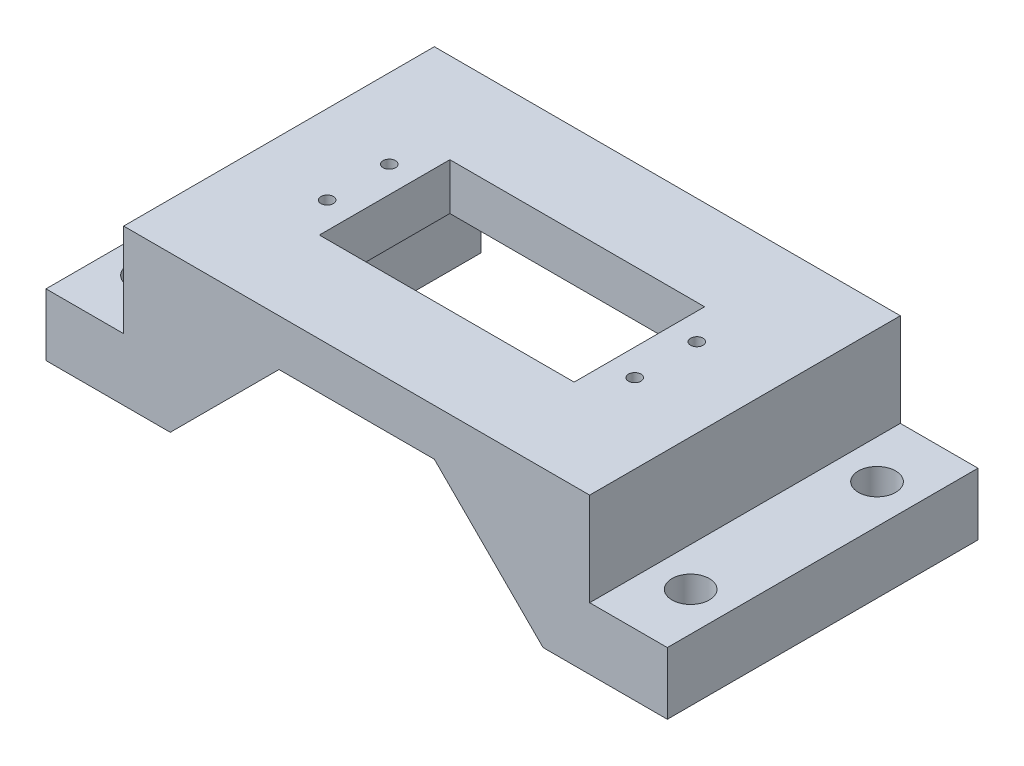
ISO-10303-21;
HEADER;
FILE_DESCRIPTION(('STEP AP214'),'2;1');
FILE_NAME('part.step','',(''),(''),'','','');
FILE_SCHEMA(('AUTOMOTIVE_DESIGN { 1 0 10303 214 1 1 1 1 }'));
ENDSEC;
DATA;
#1=APPLICATION_CONTEXT('core data for automotive mechanical design processes');
#2=APPLICATION_PROTOCOL_DEFINITION('international standard','automotive_design',2000,#1);
#3=PRODUCT_CONTEXT('',#1,'mechanical');
#4=PRODUCT('Part','Part','',(#3));
#5=PRODUCT_RELATED_PRODUCT_CATEGORY('part','',(#4));
#6=PRODUCT_DEFINITION_FORMATION('','',#4);
#7=PRODUCT_DEFINITION_CONTEXT('part definition',#1,'design');
#8=PRODUCT_DEFINITION('design','',#6,#7);
#9=PRODUCT_DEFINITION_SHAPE('','',#8);
#10=(LENGTH_UNIT() NAMED_UNIT(*) SI_UNIT(.MILLI.,.METRE.));
#11=(NAMED_UNIT(*) PLANE_ANGLE_UNIT() SI_UNIT($,.RADIAN.));
#12=(NAMED_UNIT(*) SI_UNIT($,.STERADIAN.) SOLID_ANGLE_UNIT());
#13=UNCERTAINTY_MEASURE_WITH_UNIT(LENGTH_MEASURE(1.E-05),#10,'distance_accuracy_value','');
#14=(GEOMETRIC_REPRESENTATION_CONTEXT(3) GLOBAL_UNCERTAINTY_ASSIGNED_CONTEXT((#13)) GLOBAL_UNIT_ASSIGNED_CONTEXT((#10,
#11,#12)) REPRESENTATION_CONTEXT('',''));
#15=CARTESIAN_POINT('',(0.,0.,0.));
#16=DIRECTION('',(0.,0.,1.));
#17=DIRECTION('',(1.,0.,0.));
#18=AXIS2_PLACEMENT_3D('',#15,#16,#17);
#19=CARTESIAN_POINT('',(-50.002,17.5,-25.));
#20=DIRECTION('',(0.,1.,0.));
#21=DIRECTION('',(0.,0.,1.));
#22=AXIS2_PLACEMENT_3D('',#19,#20,#21);
#23=PLANE('',#22);
#24=CARTESIAN_POINT('',(-24.75,17.5,-4.99999999999999));
#25=DIRECTION('',(0.,1.,0.));
#26=DIRECTION('',(0.,0.,1.));
#27=AXIS2_PLACEMENT_3D('',#24,#25,#26);
#28=CIRCLE('',#27,1.);
#29=CARTESIAN_POINT('',(-24.75,17.5,-3.99999999999999));
#30=VERTEX_POINT('',#29);
#31=EDGE_CURVE('E269',#30,#30,#28,.T.);
#32=ORIENTED_EDGE('',*,*,#31,.T.);
#33=EDGE_LOOP('',(#32));
#34=FACE_BOUND('',#33,.T.);
#35=CARTESIAN_POINT('',(24.75,17.5,-5.));
#36=DIRECTION('',(0.,1.,0.));
#37=DIRECTION('',(0.,0.,1.));
#38=AXIS2_PLACEMENT_3D('',#35,#36,#37);
#39=CIRCLE('',#38,1.);
#40=CARTESIAN_POINT('',(24.75,17.5,-4.));
#41=VERTEX_POINT('',#40);
#42=EDGE_CURVE('E265',#41,#41,#39,.T.);
#43=ORIENTED_EDGE('',*,*,#42,.T.);
#44=EDGE_LOOP('',(#43));
#45=FACE_BOUND('',#44,.T.);
#46=CARTESIAN_POINT('',(-24.75,17.5,5.00000000000001));
#47=DIRECTION('',(0.,1.,0.));
#48=DIRECTION('',(0.,0.,1.));
#49=AXIS2_PLACEMENT_3D('',#46,#47,#48);
#50=CIRCLE('',#49,1.);
#51=CARTESIAN_POINT('',(-24.75,17.5,6.00000000000001));
#52=VERTEX_POINT('',#51);
#53=EDGE_CURVE('E260',#52,#52,#50,.T.);
#54=ORIENTED_EDGE('',*,*,#53,.T.);
#55=EDGE_LOOP('',(#54));
#56=FACE_BOUND('',#55,.T.);
#57=DIRECTION('',(0.,0.,-1.));
#58=VECTOR('',#57,1.);
#59=CARTESIAN_POINT('',(20.5,17.5,-25.));
#60=LINE('',#59,#58);
#61=CARTESIAN_POINT('',(20.5,17.5,10.5));
#62=VERTEX_POINT('',#61);
#63=CARTESIAN_POINT('',(20.5,17.5,-10.5));
#64=VERTEX_POINT('',#63);
#65=EDGE_CURVE('E253',#62,#64,#60,.T.);
#66=ORIENTED_EDGE('',*,*,#65,.T.);
#67=DIRECTION('',(-1.,0.,0.));
#68=VECTOR('',#67,1.);
#69=CARTESIAN_POINT('',(-50.002,17.5,-10.5));
#70=LINE('',#69,#68);
#71=CARTESIAN_POINT('',(-20.5,17.5,-10.5));
#72=VERTEX_POINT('',#71);
#73=EDGE_CURVE('E256',#64,#72,#70,.T.);
#74=ORIENTED_EDGE('',*,*,#73,.T.);
#75=DIRECTION('',(0.,0.,1.));
#76=VECTOR('',#75,1.);
#77=CARTESIAN_POINT('',(-20.5,17.5,-25.));
#78=LINE('',#77,#76);
#79=CARTESIAN_POINT('',(-20.5,17.5,10.5));
#80=VERTEX_POINT('',#79);
#81=EDGE_CURVE('E242',#72,#80,#78,.T.);
#82=ORIENTED_EDGE('',*,*,#81,.T.);
#83=DIRECTION('',(1.,0.,0.));
#84=VECTOR('',#83,1.);
#85=CARTESIAN_POINT('',(-50.002,17.5,10.5));
#86=LINE('',#85,#84);
#87=EDGE_CURVE('E250',#80,#62,#86,.T.);
#88=ORIENTED_EDGE('',*,*,#87,.T.);
#89=EDGE_LOOP('',(#66,#74,#82,#88));
#90=FACE_BOUND('',#89,.T.);
#91=CARTESIAN_POINT('',(24.75,17.5,5.));
#92=DIRECTION('',(0.,1.,0.));
#93=DIRECTION('',(0.,0.,1.));
#94=AXIS2_PLACEMENT_3D('',#91,#92,#93);
#95=CIRCLE('',#94,1.);
#96=CARTESIAN_POINT('',(24.75,17.5,6.));
#97=VERTEX_POINT('',#96);
#98=EDGE_CURVE('E243',#97,#97,#95,.T.);
#99=ORIENTED_EDGE('',*,*,#98,.T.);
#100=EDGE_LOOP('',(#99));
#101=FACE_BOUND('',#100,.T.);
#102=DIRECTION('',(1.,0.,0.));
#103=VECTOR('',#102,1.);
#104=CARTESIAN_POINT('',(30.,17.5,15.));
#105=LINE('',#104,#103);
#106=CARTESIAN_POINT('',(12.5000000000001,17.5,15.));
#107=VERTEX_POINT('',#106);
#108=CARTESIAN_POINT('',(30.,17.5,15.));
#109=VERTEX_POINT('',#108);
#110=EDGE_CURVE('E167',#107,#109,#105,.T.);
#111=ORIENTED_EDGE('',*,*,#110,.F.);
#112=DIRECTION('',(0.,0.,-1.));
#113=VECTOR('',#112,1.);
#114=CARTESIAN_POINT('',(12.5000000000002,17.5,-25.));
#115=LINE('',#114,#113);
#116=CARTESIAN_POINT('',(12.5000000000001,17.5,25.));
#117=VERTEX_POINT('',#116);
#118=EDGE_CURVE('E51',#107,#117,#115,.F.);
#119=ORIENTED_EDGE('',*,*,#118,.T.);
#120=DIRECTION('',(1.,0.,0.));
#121=VECTOR('',#120,1.);
#122=CARTESIAN_POINT('',(-50.002,17.5,25.));
#123=LINE('',#122,#121);
#124=CARTESIAN_POINT('',(-12.5000000000002,17.5,25.));
#125=VERTEX_POINT('',#124);
#126=EDGE_CURVE('E188',#125,#117,#123,.T.);
#127=ORIENTED_EDGE('',*,*,#126,.F.);
#128=DIRECTION('',(0.,0.,1.));
#129=VECTOR('',#128,1.);
#130=CARTESIAN_POINT('',(-12.5000000000002,17.5,-25.));
#131=LINE('',#130,#129);
#132=CARTESIAN_POINT('',(-12.5000000000002,17.5,15.));
#133=VERTEX_POINT('',#132);
#134=EDGE_CURVE('E11',#125,#133,#131,.F.);
#135=ORIENTED_EDGE('',*,*,#134,.T.);
#136=DIRECTION('',(1.,0.,0.));
#137=VECTOR('',#136,1.);
#138=CARTESIAN_POINT('',(-30.,17.5,15.));
#139=LINE('',#138,#137);
#140=CARTESIAN_POINT('',(-30.,17.5,15.));
#141=VERTEX_POINT('',#140);
#142=EDGE_CURVE('E183',#141,#133,#139,.T.);
#143=ORIENTED_EDGE('',*,*,#142,.F.);
#144=DIRECTION('',(0.,0.,1.));
#145=VECTOR('',#144,1.);
#146=CARTESIAN_POINT('',(-30.,17.5,-25.));
#147=LINE('',#146,#145);
#148=CARTESIAN_POINT('',(-30.,17.5,-25.));
#149=VERTEX_POINT('',#148);
#150=EDGE_CURVE('E197',#149,#141,#147,.T.);
#151=ORIENTED_EDGE('',*,*,#150,.F.);
#152=DIRECTION('',(1.,0.,0.));
#153=VECTOR('',#152,1.);
#154=CARTESIAN_POINT('',(-50.002,17.5,-25.));
#155=LINE('',#154,#153);
#156=CARTESIAN_POINT('',(30.,17.5,-25.));
#157=VERTEX_POINT('',#156);
#158=EDGE_CURVE('E187',#149,#157,#155,.T.);
#159=ORIENTED_EDGE('',*,*,#158,.T.);
#160=DIRECTION('',(0.,0.,1.));
#161=VECTOR('',#160,1.);
#162=CARTESIAN_POINT('',(30.,17.5,-25.));
#163=LINE('',#162,#161);
#164=EDGE_CURVE('E180',#157,#109,#163,.T.);
#165=ORIENTED_EDGE('',*,*,#164,.T.);
#166=EDGE_LOOP('',(#111,#119,#127,#135,#143,#151,#159,#165));
#167=FACE_BOUND('',#166,.T.);
#168=ADVANCED_FACE('F41',(#34,#45,#56,#90,#101,#167),#23,.F.);
#169=CARTESIAN_POINT('',(30.,10.,0.));
#170=DIRECTION('',(-1.,0.,0.));
#171=DIRECTION('',(0.,0.,1.));
#172=AXIS2_PLACEMENT_3D('',#169,#170,#171);
#173=PLANE('',#172);
#174=DIRECTION('',(0.,0.,-1.));
#175=VECTOR('',#174,1.);
#176=CARTESIAN_POINT('',(30.,0.,0.));
#177=LINE('',#176,#175);
#178=CARTESIAN_POINT('',(30.,0.,15.));
#179=VERTEX_POINT('',#178);
#180=CARTESIAN_POINT('',(30.,0.,-25.));
#181=VERTEX_POINT('',#180);
#182=EDGE_CURVE('E182',#179,#181,#177,.T.);
#183=ORIENTED_EDGE('',*,*,#182,.F.);
#184=DIRECTION('',(0.,1.,0.));
#185=VECTOR('',#184,1.);
#186=CARTESIAN_POINT('',(30.,-22.3606797749979,15.));
#187=LINE('',#186,#185);
#188=EDGE_CURVE('E170',#179,#109,#187,.T.);
#189=ORIENTED_EDGE('',*,*,#188,.T.);
#190=ORIENTED_EDGE('',*,*,#164,.F.);
#191=DIRECTION('',(0.,-1.,0.));
#192=VECTOR('',#191,1.);
#193=CARTESIAN_POINT('',(30.,10.,-25.));
#194=LINE('',#193,#192);
#195=EDGE_CURVE('E309',#157,#181,#194,.T.);
#196=ORIENTED_EDGE('',*,*,#195,.T.);
#197=EDGE_LOOP('',(#183,#189,#190,#196));
#198=FACE_BOUND('',#197,.T.);
#199=ADVANCED_FACE('F178',(#198),#173,.T.);
#200=CARTESIAN_POINT('',(-30.,10.,0.));
#201=DIRECTION('',(-1.,0.,0.));
#202=DIRECTION('',(0.,0.,1.));
#203=AXIS2_PLACEMENT_3D('',#200,#201,#202);
#204=PLANE('',#203);
#205=DIRECTION('',(0.,1.,0.));
#206=VECTOR('',#205,1.);
#207=CARTESIAN_POINT('',(-30.,-22.3606797749979,15.));
#208=LINE('',#207,#206);
#209=CARTESIAN_POINT('',(-30.,0.,15.));
#210=VERTEX_POINT('',#209);
#211=EDGE_CURVE('E327',#210,#141,#208,.T.);
#212=ORIENTED_EDGE('',*,*,#211,.F.);
#213=DIRECTION('',(0.,0.,-1.));
#214=VECTOR('',#213,1.);
#215=CARTESIAN_POINT('',(-30.,0.,0.));
#216=LINE('',#215,#214);
#217=CARTESIAN_POINT('',(-30.,0.,-25.));
#218=VERTEX_POINT('',#217);
#219=EDGE_CURVE('E229',#210,#218,#216,.T.);
#220=ORIENTED_EDGE('',*,*,#219,.T.);
#221=DIRECTION('',(0.,-1.,0.));
#222=VECTOR('',#221,1.);
#223=CARTESIAN_POINT('',(-30.,10.,-25.));
#224=LINE('',#223,#222);
#225=EDGE_CURVE('E239',#149,#218,#224,.T.);
#226=ORIENTED_EDGE('',*,*,#225,.F.);
#227=ORIENTED_EDGE('',*,*,#150,.T.);
#228=EDGE_LOOP('',(#212,#220,#226,#227));
#229=FACE_BOUND('',#228,.T.);
#230=ADVANCED_FACE('F324',(#229),#204,.F.);
#231=CARTESIAN_POINT('',(0.,10.,25.));
#232=DIRECTION('',(0.,0.,-1.));
#233=DIRECTION('',(-1.,0.,0.));
#234=AXIS2_PLACEMENT_3D('',#231,#232,#233);
#235=PLANE('',#234);
#236=ORIENTED_EDGE('',*,*,#126,.T.);
#237=DIRECTION('',(-0.707106781186551,0.707106781186544,0.));
#238=VECTOR('',#237,1.);
#239=CARTESIAN_POINT('',(9.99999999999997,20.0000000000001,25.));
#240=LINE('',#239,#238);
#241=CARTESIAN_POINT('',(30.0000000000003,0.,25.));
#242=VERTEX_POINT('',#241);
#243=EDGE_CURVE('E275',#117,#242,#240,.F.);
#244=ORIENTED_EDGE('',*,*,#243,.T.);
#245=DIRECTION('',(1.,0.,0.));
#246=VECTOR('',#245,1.);
#247=CARTESIAN_POINT('',(0.,0.,25.));
#248=LINE('',#247,#246);
#249=CARTESIAN_POINT('',(50.,0.,25.));
#250=VERTEX_POINT('',#249);
#251=EDGE_CURVE('E293',#242,#250,#248,.T.);
#252=ORIENTED_EDGE('',*,*,#251,.T.);
#253=DIRECTION('',(0.,-1.,0.));
#254=VECTOR('',#253,1.);
#255=CARTESIAN_POINT('',(50.,10.,25.));
#256=LINE('',#255,#254);
#257=CARTESIAN_POINT('',(50.,10.,25.));
#258=VERTEX_POINT('',#257);
#259=EDGE_CURVE('E189',#258,#250,#256,.T.);
#260=ORIENTED_EDGE('',*,*,#259,.F.);
#261=DIRECTION('',(1.,0.,0.));
#262=VECTOR('',#261,1.);
#263=CARTESIAN_POINT('',(0.,10.,25.));
#264=LINE('',#263,#262);
#265=CARTESIAN_POINT('',(37.5,10.,25.));
#266=VERTEX_POINT('',#265);
#267=EDGE_CURVE('E308',#266,#258,#264,.T.);
#268=ORIENTED_EDGE('',*,*,#267,.F.);
#269=DIRECTION('',(0.,-1.,0.));
#270=VECTOR('',#269,1.);
#271=CARTESIAN_POINT('',(37.5,25.,25.));
#272=LINE('',#271,#270);
#273=CARTESIAN_POINT('',(37.5,25.,25.));
#274=VERTEX_POINT('',#273);
#275=EDGE_CURVE('E303',#274,#266,#272,.T.);
#276=ORIENTED_EDGE('',*,*,#275,.F.);
#277=DIRECTION('',(1.,0.,0.));
#278=VECTOR('',#277,1.);
#279=CARTESIAN_POINT('',(-30.,25.,25.));
#280=LINE('',#279,#278);
#281=CARTESIAN_POINT('',(-37.5,25.,25.));
#282=VERTEX_POINT('',#281);
#283=EDGE_CURVE('E206',#282,#274,#280,.T.);
#284=ORIENTED_EDGE('',*,*,#283,.F.);
#285=DIRECTION('',(0.,-1.,0.));
#286=VECTOR('',#285,1.);
#287=CARTESIAN_POINT('',(-37.5,25.,25.));
#288=LINE('',#287,#286);
#289=CARTESIAN_POINT('',(-37.5,10.,25.));
#290=VERTEX_POINT('',#289);
#291=EDGE_CURVE('E208',#282,#290,#288,.T.);
#292=ORIENTED_EDGE('',*,*,#291,.T.);
#293=DIRECTION('',(1.,0.,0.));
#294=VECTOR('',#293,1.);
#295=CARTESIAN_POINT('',(0.,10.,25.));
#296=LINE('',#295,#294);
#297=CARTESIAN_POINT('',(-50.,10.,25.));
#298=VERTEX_POINT('',#297);
#299=EDGE_CURVE('E217',#298,#290,#296,.T.);
#300=ORIENTED_EDGE('',*,*,#299,.F.);
#301=DIRECTION('',(0.,-1.,0.));
#302=VECTOR('',#301,1.);
#303=CARTESIAN_POINT('',(-50.,10.,25.));
#304=LINE('',#303,#302);
#305=CARTESIAN_POINT('',(-50.,0.,25.));
#306=VERTEX_POINT('',#305);
#307=EDGE_CURVE('E226',#298,#306,#304,.T.);
#308=ORIENTED_EDGE('',*,*,#307,.T.);
#309=DIRECTION('',(1.,0.,0.));
#310=VECTOR('',#309,1.);
#311=CARTESIAN_POINT('',(0.,0.,25.));
#312=LINE('',#311,#310);
#313=CARTESIAN_POINT('',(-30.0000000000004,0.,25.));
#314=VERTEX_POINT('',#313);
#315=EDGE_CURVE('E216',#306,#314,#312,.T.);
#316=ORIENTED_EDGE('',*,*,#315,.T.);
#317=DIRECTION('',(-0.707106781186551,-0.707106781186544,0.));
#318=VECTOR('',#317,1.);
#319=CARTESIAN_POINT('',(-10.,20.0000000000001,25.));
#320=LINE('',#319,#318);
#321=EDGE_CURVE('E259',#314,#125,#320,.F.);
#322=ORIENTED_EDGE('',*,*,#321,.T.);
#323=EDGE_LOOP('',(#236,#244,#252,#260,#268,#276,#284,#292,#300,#308,#316,#322));
#324=FACE_BOUND('',#323,.T.);
#325=ADVANCED_FACE('F291',(#324),#235,.F.);
#326=CARTESIAN_POINT('',(0.,10.,-25.));
#327=DIRECTION('',(0.,0.,-1.));
#328=DIRECTION('',(-1.,0.,0.));
#329=AXIS2_PLACEMENT_3D('',#326,#327,#328);
#330=PLANE('',#329);
#331=DIRECTION('',(1.,0.,0.));
#332=VECTOR('',#331,1.);
#333=CARTESIAN_POINT('',(0.,0.,-25.));
#334=LINE('',#333,#332);
#335=CARTESIAN_POINT('',(-50.,0.,-25.));
#336=VERTEX_POINT('',#335);
#337=EDGE_CURVE('E231',#336,#218,#334,.T.);
#338=ORIENTED_EDGE('',*,*,#337,.F.);
#339=DIRECTION('',(0.,-1.,0.));
#340=VECTOR('',#339,1.);
#341=CARTESIAN_POINT('',(-50.,10.,-25.));
#342=LINE('',#341,#340);
#343=CARTESIAN_POINT('',(-50.,10.,-25.));
#344=VERTEX_POINT('',#343);
#345=EDGE_CURVE('E237',#344,#336,#342,.T.);
#346=ORIENTED_EDGE('',*,*,#345,.F.);
#347=DIRECTION('',(1.,0.,0.));
#348=VECTOR('',#347,1.);
#349=CARTESIAN_POINT('',(0.,10.,-25.));
#350=LINE('',#349,#348);
#351=CARTESIAN_POINT('',(-37.5,10.,-25.));
#352=VERTEX_POINT('',#351);
#353=EDGE_CURVE('E219',#344,#352,#350,.T.);
#354=ORIENTED_EDGE('',*,*,#353,.T.);
#355=DIRECTION('',(0.,-1.,0.));
#356=VECTOR('',#355,1.);
#357=CARTESIAN_POINT('',(-37.5,25.,-25.));
#358=LINE('',#357,#356);
#359=CARTESIAN_POINT('',(-37.5,25.,-25.));
#360=VERTEX_POINT('',#359);
#361=EDGE_CURVE('E213',#360,#352,#358,.T.);
#362=ORIENTED_EDGE('',*,*,#361,.F.);
#363=DIRECTION('',(-1.,0.,0.));
#364=VECTOR('',#363,1.);
#365=CARTESIAN_POINT('',(-30.,25.,-25.));
#366=LINE('',#365,#364);
#367=CARTESIAN_POINT('',(37.5,25.,-25.));
#368=VERTEX_POINT('',#367);
#369=EDGE_CURVE('E202',#368,#360,#366,.T.);
#370=ORIENTED_EDGE('',*,*,#369,.F.);
#371=DIRECTION('',(0.,-1.,0.));
#372=VECTOR('',#371,1.);
#373=CARTESIAN_POINT('',(37.5,25.,-25.));
#374=LINE('',#373,#372);
#375=CARTESIAN_POINT('',(37.5,10.,-25.));
#376=VERTEX_POINT('',#375);
#377=EDGE_CURVE('E357',#368,#376,#374,.T.);
#378=ORIENTED_EDGE('',*,*,#377,.T.);
#379=DIRECTION('',(1.,0.,0.));
#380=VECTOR('',#379,1.);
#381=CARTESIAN_POINT('',(0.,10.,-25.));
#382=LINE('',#381,#380);
#383=CARTESIAN_POINT('',(50.,10.,-25.));
#384=VERTEX_POINT('',#383);
#385=EDGE_CURVE('E310',#376,#384,#382,.T.);
#386=ORIENTED_EDGE('',*,*,#385,.T.);
#387=DIRECTION('',(0.,-1.,0.));
#388=VECTOR('',#387,1.);
#389=CARTESIAN_POINT('',(50.,10.,-25.));
#390=LINE('',#389,#388);
#391=CARTESIAN_POINT('',(50.,0.,-25.));
#392=VERTEX_POINT('',#391);
#393=EDGE_CURVE('E193',#384,#392,#390,.T.);
#394=ORIENTED_EDGE('',*,*,#393,.T.);
#395=DIRECTION('',(1.,0.,0.));
#396=VECTOR('',#395,1.);
#397=CARTESIAN_POINT('',(0.,0.,-25.));
#398=LINE('',#397,#396);
#399=EDGE_CURVE('E301',#181,#392,#398,.T.);
#400=ORIENTED_EDGE('',*,*,#399,.F.);
#401=ORIENTED_EDGE('',*,*,#195,.F.);
#402=ORIENTED_EDGE('',*,*,#158,.F.);
#403=ORIENTED_EDGE('',*,*,#225,.T.);
#404=EDGE_LOOP('',(#338,#346,#354,#362,#370,#378,#386,#394,#400,#401,#402,#403));
#405=FACE_BOUND('',#404,.T.);
#406=ADVANCED_FACE('F315',(#405),#330,.T.);
#407=CARTESIAN_POINT('',(-50.,10.,0.));
#408=DIRECTION('',(-1.,0.,0.));
#409=DIRECTION('',(0.,0.,1.));
#410=AXIS2_PLACEMENT_3D('',#407,#408,#409);
#411=PLANE('',#410);
#412=DIRECTION('',(0.,0.,-1.));
#413=VECTOR('',#412,1.);
#414=CARTESIAN_POINT('',(-50.,0.,0.));
#415=LINE('',#414,#413);
#416=EDGE_CURVE('E220',#306,#336,#415,.T.);
#417=ORIENTED_EDGE('',*,*,#416,.F.);
#418=ORIENTED_EDGE('',*,*,#307,.F.);
#419=DIRECTION('',(0.,0.,-1.));
#420=VECTOR('',#419,1.);
#421=CARTESIAN_POINT('',(-50.,10.,0.));
#422=LINE('',#421,#420);
#423=EDGE_CURVE('E223',#298,#344,#422,.T.);
#424=ORIENTED_EDGE('',*,*,#423,.T.);
#425=ORIENTED_EDGE('',*,*,#345,.T.);
#426=EDGE_LOOP('',(#417,#418,#424,#425));
#427=FACE_BOUND('',#426,.T.);
#428=ADVANCED_FACE('F337',(#427),#411,.T.);
#429=CARTESIAN_POINT('',(0.,10.,0.));
#430=DIRECTION('',(0.,1.,0.));
#431=DIRECTION('',(0.,0.,1.));
#432=AXIS2_PLACEMENT_3D('',#429,#430,#431);
#433=PLANE('',#432);
#434=CARTESIAN_POINT('',(-43.75,10.,-15.));
#435=DIRECTION('',(0.,1.,0.));
#436=DIRECTION('',(0.,0.,1.));
#437=AXIS2_PLACEMENT_3D('',#434,#435,#436);
#438=CIRCLE('',#437,3.);
#439=CARTESIAN_POINT('',(-43.75,10.,-12.));
#440=VERTEX_POINT('',#439);
#441=EDGE_CURVE('E424',#440,#440,#438,.T.);
#442=ORIENTED_EDGE('',*,*,#441,.F.);
#443=EDGE_LOOP('',(#442));
#444=FACE_BOUND('',#443,.T.);
#445=CARTESIAN_POINT('',(-43.75,10.,15.));
#446=DIRECTION('',(0.,1.,0.));
#447=DIRECTION('',(0.,0.,1.));
#448=AXIS2_PLACEMENT_3D('',#445,#446,#447);
#449=CIRCLE('',#448,3.);
#450=CARTESIAN_POINT('',(-43.75,10.,18.));
#451=VERTEX_POINT('',#450);
#452=EDGE_CURVE('E418',#451,#451,#449,.T.);
#453=ORIENTED_EDGE('',*,*,#452,.F.);
#454=EDGE_LOOP('',(#453));
#455=FACE_BOUND('',#454,.T.);
#456=DIRECTION('',(0.,0.,1.));
#457=VECTOR('',#456,1.);
#458=CARTESIAN_POINT('',(-37.5,10.,-25.));
#459=LINE('',#458,#457);
#460=EDGE_CURVE('E201',#352,#290,#459,.T.);
#461=ORIENTED_EDGE('',*,*,#460,.F.);
#462=ORIENTED_EDGE('',*,*,#353,.F.);
#463=ORIENTED_EDGE('',*,*,#423,.F.);
#464=ORIENTED_EDGE('',*,*,#299,.T.);
#465=EDGE_LOOP('',(#461,#462,#463,#464));
#466=FACE_BOUND('',#465,.T.);
#467=ADVANCED_FACE('F342',(#444,#455,#466),#433,.T.);
#468=CARTESIAN_POINT('',(0.,0.,0.));
#469=DIRECTION('',(0.,1.,0.));
#470=DIRECTION('',(0.,0.,1.));
#471=AXIS2_PLACEMENT_3D('',#468,#469,#470);
#472=PLANE('',#471);
#473=CARTESIAN_POINT('',(-43.75,0.,-15.));
#474=DIRECTION('',(0.,1.,0.));
#475=DIRECTION('',(0.,0.,1.));
#476=AXIS2_PLACEMENT_3D('',#473,#474,#475);
#477=CIRCLE('',#476,3.);
#478=CARTESIAN_POINT('',(-43.75,0.,-12.));
#479=VERTEX_POINT('',#478);
#480=EDGE_CURVE('E421',#479,#479,#477,.T.);
#481=ORIENTED_EDGE('',*,*,#480,.T.);
#482=EDGE_LOOP('',(#481));
#483=FACE_BOUND('',#482,.T.);
#484=CARTESIAN_POINT('',(-43.75,0.,15.));
#485=DIRECTION('',(0.,1.,0.));
#486=DIRECTION('',(0.,0.,1.));
#487=AXIS2_PLACEMENT_3D('',#484,#485,#486);
#488=CIRCLE('',#487,3.);
#489=CARTESIAN_POINT('',(-43.75,0.,18.));
#490=VERTEX_POINT('',#489);
#491=EDGE_CURVE('E415',#490,#490,#488,.T.);
#492=ORIENTED_EDGE('',*,*,#491,.T.);
#493=EDGE_LOOP('',(#492));
#494=FACE_BOUND('',#493,.T.);
#495=ORIENTED_EDGE('',*,*,#219,.F.);
#496=DIRECTION('',(0.,0.,1.));
#497=VECTOR('',#496,1.);
#498=CARTESIAN_POINT('',(-30.0000000000004,0.,0.));
#499=LINE('',#498,#497);
#500=EDGE_CURVE('E283',#210,#314,#499,.T.);
#501=ORIENTED_EDGE('',*,*,#500,.T.);
#502=ORIENTED_EDGE('',*,*,#315,.F.);
#503=ORIENTED_EDGE('',*,*,#416,.T.);
#504=ORIENTED_EDGE('',*,*,#337,.T.);
#505=EDGE_LOOP('',(#495,#501,#502,#503,#504));
#506=FACE_BOUND('',#505,.T.);
#507=ADVANCED_FACE('F330',(#483,#494,#506),#472,.F.);
#508=CARTESIAN_POINT('',(-37.5,25.,-25.));
#509=DIRECTION('',(1.,0.,0.));
#510=DIRECTION('',(0.,0.,-1.));
#511=AXIS2_PLACEMENT_3D('',#508,#509,#510);
#512=PLANE('',#511);
#513=ORIENTED_EDGE('',*,*,#460,.T.);
#514=ORIENTED_EDGE('',*,*,#291,.F.);
#515=DIRECTION('',(0.,0.,1.));
#516=VECTOR('',#515,1.);
#517=CARTESIAN_POINT('',(-37.5,25.,-25.));
#518=LINE('',#517,#516);
#519=EDGE_CURVE('E204',#360,#282,#518,.T.);
#520=ORIENTED_EDGE('',*,*,#519,.F.);
#521=ORIENTED_EDGE('',*,*,#361,.T.);
#522=EDGE_LOOP('',(#513,#514,#520,#521));
#523=FACE_BOUND('',#522,.T.);
#524=ADVANCED_FACE('F345',(#523),#512,.F.);
#525=CARTESIAN_POINT('',(0.,25.,0.));
#526=DIRECTION('',(0.,-1.,0.));
#527=DIRECTION('',(0.,0.,-1.));
#528=AXIS2_PLACEMENT_3D('',#525,#526,#527);
#529=PLANE('',#528);
#530=CARTESIAN_POINT('',(-24.75,25.,-4.99999999999999));
#531=DIRECTION('',(0.,-1.,0.));
#532=DIRECTION('',(0.,0.,-1.));
#533=AXIS2_PLACEMENT_3D('',#530,#531,#532);
#534=CIRCLE('',#533,1.);
#535=CARTESIAN_POINT('',(-24.75,25.,-5.99999999999999));
#536=VERTEX_POINT('',#535);
#537=EDGE_CURVE('E272',#536,#536,#534,.T.);
#538=ORIENTED_EDGE('',*,*,#537,.T.);
#539=EDGE_LOOP('',(#538));
#540=FACE_BOUND('',#539,.T.);
#541=CARTESIAN_POINT('',(24.75,25.,-5.));
#542=DIRECTION('',(0.,-1.,0.));
#543=DIRECTION('',(0.,0.,-1.));
#544=AXIS2_PLACEMENT_3D('',#541,#542,#543);
#545=CIRCLE('',#544,1.);
#546=CARTESIAN_POINT('',(24.75,25.,-6.));
#547=VERTEX_POINT('',#546);
#548=EDGE_CURVE('E268',#547,#547,#545,.T.);
#549=ORIENTED_EDGE('',*,*,#548,.T.);
#550=EDGE_LOOP('',(#549));
#551=FACE_BOUND('',#550,.T.);
#552=CARTESIAN_POINT('',(-24.75,25.,5.00000000000001));
#553=DIRECTION('',(0.,-1.,0.));
#554=DIRECTION('',(0.,0.,-1.));
#555=AXIS2_PLACEMENT_3D('',#552,#553,#554);
#556=CIRCLE('',#555,1.);
#557=CARTESIAN_POINT('',(-24.75,25.,4.00000000000001));
#558=VERTEX_POINT('',#557);
#559=EDGE_CURVE('E263',#558,#558,#556,.T.);
#560=ORIENTED_EDGE('',*,*,#559,.T.);
#561=EDGE_LOOP('',(#560));
#562=FACE_BOUND('',#561,.T.);
#563=DIRECTION('',(0.,0.,-1.));
#564=VECTOR('',#563,1.);
#565=CARTESIAN_POINT('',(-20.5,25.,0.));
#566=LINE('',#565,#564);
#567=CARTESIAN_POINT('',(-20.5,25.,10.5));
#568=VERTEX_POINT('',#567);
#569=CARTESIAN_POINT('',(-20.5,25.,-10.5));
#570=VERTEX_POINT('',#569);
#571=EDGE_CURVE('E388',#568,#570,#566,.T.);
#572=ORIENTED_EDGE('',*,*,#571,.T.);
#573=DIRECTION('',(1.,0.,0.));
#574=VECTOR('',#573,1.);
#575=CARTESIAN_POINT('',(0.,25.,-10.5));
#576=LINE('',#575,#574);
#577=CARTESIAN_POINT('',(20.5,25.,-10.5));
#578=VERTEX_POINT('',#577);
#579=EDGE_CURVE('E264',#570,#578,#576,.T.);
#580=ORIENTED_EDGE('',*,*,#579,.T.);
#581=DIRECTION('',(0.,0.,1.));
#582=VECTOR('',#581,1.);
#583=CARTESIAN_POINT('',(20.5,25.,0.));
#584=LINE('',#583,#582);
#585=CARTESIAN_POINT('',(20.5,25.,10.5));
#586=VERTEX_POINT('',#585);
#587=EDGE_CURVE('E382',#578,#586,#584,.T.);
#588=ORIENTED_EDGE('',*,*,#587,.T.);
#589=DIRECTION('',(-1.,0.,0.));
#590=VECTOR('',#589,1.);
#591=CARTESIAN_POINT('',(0.,25.,10.5));
#592=LINE('',#591,#590);
#593=EDGE_CURVE('E385',#586,#568,#592,.T.);
#594=ORIENTED_EDGE('',*,*,#593,.T.);
#595=EDGE_LOOP('',(#572,#580,#588,#594));
#596=FACE_BOUND('',#595,.T.);
#597=CARTESIAN_POINT('',(24.75,25.,5.));
#598=DIRECTION('',(0.,-1.,0.));
#599=DIRECTION('',(0.,0.,-1.));
#600=AXIS2_PLACEMENT_3D('',#597,#598,#599);
#601=CIRCLE('',#600,1.);
#602=CARTESIAN_POINT('',(24.75,25.,4.));
#603=VERTEX_POINT('',#602);
#604=EDGE_CURVE('E246',#603,#603,#601,.T.);
#605=ORIENTED_EDGE('',*,*,#604,.T.);
#606=EDGE_LOOP('',(#605));
#607=FACE_BOUND('',#606,.T.);
#608=ORIENTED_EDGE('',*,*,#283,.T.);
#609=DIRECTION('',(0.,0.,-1.));
#610=VECTOR('',#609,1.);
#611=CARTESIAN_POINT('',(37.5,25.,25.));
#612=LINE('',#611,#610);
#613=EDGE_CURVE('E355',#274,#368,#612,.T.);
#614=ORIENTED_EDGE('',*,*,#613,.T.);
#615=ORIENTED_EDGE('',*,*,#369,.T.);
#616=ORIENTED_EDGE('',*,*,#519,.T.);
#617=EDGE_LOOP('',(#608,#614,#615,#616));
#618=FACE_BOUND('',#617,.T.);
#619=ADVANCED_FACE('F354',(#540,#551,#562,#596,#607,#618),#529,.F.);
#620=CARTESIAN_POINT('',(50.,10.,0.));
#621=DIRECTION('',(-1.,0.,0.));
#622=DIRECTION('',(0.,0.,1.));
#623=AXIS2_PLACEMENT_3D('',#620,#621,#622);
#624=PLANE('',#623);
#625=DIRECTION('',(0.,0.,-1.));
#626=VECTOR('',#625,1.);
#627=CARTESIAN_POINT('',(50.,0.,0.));
#628=LINE('',#627,#626);
#629=EDGE_CURVE('E299',#250,#392,#628,.T.);
#630=ORIENTED_EDGE('',*,*,#629,.T.);
#631=ORIENTED_EDGE('',*,*,#393,.F.);
#632=DIRECTION('',(0.,0.,-1.));
#633=VECTOR('',#632,1.);
#634=CARTESIAN_POINT('',(50.,10.,0.));
#635=LINE('',#634,#633);
#636=EDGE_CURVE('E367',#258,#384,#635,.T.);
#637=ORIENTED_EDGE('',*,*,#636,.F.);
#638=ORIENTED_EDGE('',*,*,#259,.T.);
#639=EDGE_LOOP('',(#630,#631,#637,#638));
#640=FACE_BOUND('',#639,.T.);
#641=ADVANCED_FACE('F320',(#640),#624,.F.);
#642=CARTESIAN_POINT('',(0.,10.,0.));
#643=DIRECTION('',(0.,1.,0.));
#644=DIRECTION('',(0.,0.,1.));
#645=AXIS2_PLACEMENT_3D('',#642,#643,#644);
#646=PLANE('',#645);
#647=CARTESIAN_POINT('',(43.75,10.,15.));
#648=DIRECTION('',(0.,1.,0.));
#649=DIRECTION('',(0.,0.,1.));
#650=AXIS2_PLACEMENT_3D('',#647,#648,#649);
#651=CIRCLE('',#650,3.);
#652=CARTESIAN_POINT('',(43.75,10.,18.));
#653=VERTEX_POINT('',#652);
#654=EDGE_CURVE('E412',#653,#653,#651,.T.);
#655=ORIENTED_EDGE('',*,*,#654,.F.);
#656=EDGE_LOOP('',(#655));
#657=FACE_BOUND('',#656,.T.);
#658=CARTESIAN_POINT('',(43.75,10.,-15.));
#659=DIRECTION('',(0.,1.,0.));
#660=DIRECTION('',(0.,0.,1.));
#661=AXIS2_PLACEMENT_3D('',#658,#659,#660);
#662=CIRCLE('',#661,3.);
#663=CARTESIAN_POINT('',(43.75,10.,-12.));
#664=VERTEX_POINT('',#663);
#665=EDGE_CURVE('E406',#664,#664,#662,.T.);
#666=ORIENTED_EDGE('',*,*,#665,.F.);
#667=EDGE_LOOP('',(#666));
#668=FACE_BOUND('',#667,.T.);
#669=DIRECTION('',(0.,0.,-1.));
#670=VECTOR('',#669,1.);
#671=CARTESIAN_POINT('',(37.5,10.,25.));
#672=LINE('',#671,#670);
#673=EDGE_CURVE('E362',#266,#376,#672,.T.);
#674=ORIENTED_EDGE('',*,*,#673,.F.);
#675=ORIENTED_EDGE('',*,*,#267,.T.);
#676=ORIENTED_EDGE('',*,*,#636,.T.);
#677=ORIENTED_EDGE('',*,*,#385,.F.);
#678=EDGE_LOOP('',(#674,#675,#676,#677));
#679=FACE_BOUND('',#678,.T.);
#680=ADVANCED_FACE('F369',(#657,#668,#679),#646,.T.);
#681=CARTESIAN_POINT('',(0.,0.,0.));
#682=DIRECTION('',(0.,1.,0.));
#683=DIRECTION('',(0.,0.,1.));
#684=AXIS2_PLACEMENT_3D('',#681,#682,#683);
#685=PLANE('',#684);
#686=CARTESIAN_POINT('',(43.75,0.,15.));
#687=DIRECTION('',(0.,1.,0.));
#688=DIRECTION('',(0.,0.,1.));
#689=AXIS2_PLACEMENT_3D('',#686,#687,#688);
#690=CIRCLE('',#689,3.);
#691=CARTESIAN_POINT('',(43.75,0.,18.));
#692=VERTEX_POINT('',#691);
#693=EDGE_CURVE('E409',#692,#692,#690,.T.);
#694=ORIENTED_EDGE('',*,*,#693,.T.);
#695=EDGE_LOOP('',(#694));
#696=FACE_BOUND('',#695,.T.);
#697=CARTESIAN_POINT('',(43.75,0.,-15.));
#698=DIRECTION('',(0.,1.,0.));
#699=DIRECTION('',(0.,0.,1.));
#700=AXIS2_PLACEMENT_3D('',#697,#698,#699);
#701=CIRCLE('',#700,3.);
#702=CARTESIAN_POINT('',(43.75,0.,-12.));
#703=VERTEX_POINT('',#702);
#704=EDGE_CURVE('E396',#703,#703,#701,.T.);
#705=ORIENTED_EDGE('',*,*,#704,.T.);
#706=EDGE_LOOP('',(#705));
#707=FACE_BOUND('',#706,.T.);
#708=ORIENTED_EDGE('',*,*,#251,.F.);
#709=DIRECTION('',(0.,0.,-1.));
#710=VECTOR('',#709,1.);
#711=CARTESIAN_POINT('',(30.0000000000003,0.,0.));
#712=LINE('',#711,#710);
#713=EDGE_CURVE('E277',#242,#179,#712,.T.);
#714=ORIENTED_EDGE('',*,*,#713,.T.);
#715=ORIENTED_EDGE('',*,*,#182,.T.);
#716=ORIENTED_EDGE('',*,*,#399,.T.);
#717=ORIENTED_EDGE('',*,*,#629,.F.);
#718=EDGE_LOOP('',(#708,#714,#715,#716,#717));
#719=FACE_BOUND('',#718,.T.);
#720=ADVANCED_FACE('F296',(#696,#707,#719),#685,.F.);
#721=CARTESIAN_POINT('',(37.5,25.,25.));
#722=DIRECTION('',(-1.,0.,0.));
#723=DIRECTION('',(0.,0.,1.));
#724=AXIS2_PLACEMENT_3D('',#721,#722,#723);
#725=PLANE('',#724);
#726=ORIENTED_EDGE('',*,*,#673,.T.);
#727=ORIENTED_EDGE('',*,*,#377,.F.);
#728=ORIENTED_EDGE('',*,*,#613,.F.);
#729=ORIENTED_EDGE('',*,*,#275,.T.);
#730=EDGE_LOOP('',(#726,#727,#728,#729));
#731=FACE_BOUND('',#730,.T.);
#732=ADVANCED_FACE('F370',(#731),#725,.F.);
#733=CARTESIAN_POINT('',(24.75,0.,5.));
#734=DIRECTION('',(0.,1.,0.));
#735=DIRECTION('',(0.,0.,1.));
#736=AXIS2_PLACEMENT_3D('',#733,#734,#735);
#737=CYLINDRICAL_SURFACE('',#736,1.);
#738=ORIENTED_EDGE('',*,*,#98,.F.);
#739=EDGE_LOOP('',(#738));
#740=FACE_BOUND('',#739,.T.);
#741=ORIENTED_EDGE('',*,*,#604,.F.);
#742=EDGE_LOOP('',(#741));
#743=FACE_BOUND('',#742,.T.);
#744=ADVANCED_FACE('F614',(#740,#743),#737,.F.);
#745=CARTESIAN_POINT('',(20.5,0.,-10.5));
#746=DIRECTION('',(0.,0.,-1.));
#747=DIRECTION('',(-1.,0.,0.));
#748=AXIS2_PLACEMENT_3D('',#745,#746,#747);
#749=PLANE('',#748);
#750=DIRECTION('',(0.,1.,0.));
#751=VECTOR('',#750,1.);
#752=CARTESIAN_POINT('',(-20.5,0.,-10.5));
#753=LINE('',#752,#751);
#754=EDGE_CURVE('E393',#72,#570,#753,.T.);
#755=ORIENTED_EDGE('',*,*,#754,.F.);
#756=ORIENTED_EDGE('',*,*,#73,.F.);
#757=DIRECTION('',(0.,1.,0.));
#758=VECTOR('',#757,1.);
#759=CARTESIAN_POINT('',(20.5,0.,-10.5));
#760=LINE('',#759,#758);
#761=EDGE_CURVE('E247',#64,#578,#760,.T.);
#762=ORIENTED_EDGE('',*,*,#761,.T.);
#763=ORIENTED_EDGE('',*,*,#579,.F.);
#764=EDGE_LOOP('',(#755,#756,#762,#763));
#765=FACE_BOUND('',#764,.T.);
#766=ADVANCED_FACE('F606',(#765),#749,.F.);
#767=CARTESIAN_POINT('',(20.5,0.,10.5));
#768=DIRECTION('',(1.,0.,0.));
#769=DIRECTION('',(0.,0.,-1.));
#770=AXIS2_PLACEMENT_3D('',#767,#768,#769);
#771=PLANE('',#770);
#772=ORIENTED_EDGE('',*,*,#761,.F.);
#773=ORIENTED_EDGE('',*,*,#65,.F.);
#774=DIRECTION('',(0.,1.,0.));
#775=VECTOR('',#774,1.);
#776=CARTESIAN_POINT('',(20.5,0.,10.5));
#777=LINE('',#776,#775);
#778=EDGE_CURVE('E399',#62,#586,#777,.T.);
#779=ORIENTED_EDGE('',*,*,#778,.T.);
#780=ORIENTED_EDGE('',*,*,#587,.F.);
#781=EDGE_LOOP('',(#772,#773,#779,#780));
#782=FACE_BOUND('',#781,.T.);
#783=ADVANCED_FACE('F598',(#782),#771,.F.);
#784=CARTESIAN_POINT('',(20.5,0.,10.5));
#785=DIRECTION('',(0.,0.,1.));
#786=DIRECTION('',(1.,0.,0.));
#787=AXIS2_PLACEMENT_3D('',#784,#785,#786);
#788=PLANE('',#787);
#789=ORIENTED_EDGE('',*,*,#778,.F.);
#790=ORIENTED_EDGE('',*,*,#87,.F.);
#791=DIRECTION('',(0.,1.,0.));
#792=VECTOR('',#791,1.);
#793=CARTESIAN_POINT('',(-20.5,0.,10.5));
#794=LINE('',#793,#792);
#795=EDGE_CURVE('E395',#80,#568,#794,.T.);
#796=ORIENTED_EDGE('',*,*,#795,.T.);
#797=ORIENTED_EDGE('',*,*,#593,.F.);
#798=EDGE_LOOP('',(#789,#790,#796,#797));
#799=FACE_BOUND('',#798,.T.);
#800=ADVANCED_FACE('F590',(#799),#788,.F.);
#801=CARTESIAN_POINT('',(-20.5,0.,10.5));
#802=DIRECTION('',(-1.,0.,0.));
#803=DIRECTION('',(0.,0.,1.));
#804=AXIS2_PLACEMENT_3D('',#801,#802,#803);
#805=PLANE('',#804);
#806=ORIENTED_EDGE('',*,*,#795,.F.);
#807=ORIENTED_EDGE('',*,*,#81,.F.);
#808=ORIENTED_EDGE('',*,*,#754,.T.);
#809=ORIENTED_EDGE('',*,*,#571,.F.);
#810=EDGE_LOOP('',(#806,#807,#808,#809));
#811=FACE_BOUND('',#810,.T.);
#812=ADVANCED_FACE('F582',(#811),#805,.F.);
#813=CARTESIAN_POINT('',(-24.75,0.,5.00000000000001));
#814=DIRECTION('',(0.,1.,0.));
#815=DIRECTION('',(0.,0.,1.));
#816=AXIS2_PLACEMENT_3D('',#813,#814,#815);
#817=CYLINDRICAL_SURFACE('',#816,1.);
#818=ORIENTED_EDGE('',*,*,#53,.F.);
#819=EDGE_LOOP('',(#818));
#820=FACE_BOUND('',#819,.T.);
#821=ORIENTED_EDGE('',*,*,#559,.F.);
#822=EDGE_LOOP('',(#821));
#823=FACE_BOUND('',#822,.T.);
#824=ADVANCED_FACE('F574',(#820,#823),#817,.F.);
#825=CARTESIAN_POINT('',(24.75,0.,-5.));
#826=DIRECTION('',(0.,1.,0.));
#827=DIRECTION('',(0.,0.,1.));
#828=AXIS2_PLACEMENT_3D('',#825,#826,#827);
#829=CYLINDRICAL_SURFACE('',#828,1.);
#830=ORIENTED_EDGE('',*,*,#42,.F.);
#831=EDGE_LOOP('',(#830));
#832=FACE_BOUND('',#831,.T.);
#833=ORIENTED_EDGE('',*,*,#548,.F.);
#834=EDGE_LOOP('',(#833));
#835=FACE_BOUND('',#834,.T.);
#836=ADVANCED_FACE('F566',(#832,#835),#829,.F.);
#837=CARTESIAN_POINT('',(-24.75,0.,-4.99999999999999));
#838=DIRECTION('',(0.,1.,0.));
#839=DIRECTION('',(0.,0.,1.));
#840=AXIS2_PLACEMENT_3D('',#837,#838,#839);
#841=CYLINDRICAL_SURFACE('',#840,1.);
#842=ORIENTED_EDGE('',*,*,#31,.F.);
#843=EDGE_LOOP('',(#842));
#844=FACE_BOUND('',#843,.T.);
#845=ORIENTED_EDGE('',*,*,#537,.F.);
#846=EDGE_LOOP('',(#845));
#847=FACE_BOUND('',#846,.T.);
#848=ADVANCED_FACE('F557',(#844,#847),#841,.F.);
#849=CARTESIAN_POINT('',(43.75,10.,-15.));
#850=DIRECTION('',(0.,1.,0.));
#851=DIRECTION('',(0.,0.,1.));
#852=AXIS2_PLACEMENT_3D('',#849,#850,#851);
#853=CYLINDRICAL_SURFACE('',#852,3.);
#854=ORIENTED_EDGE('',*,*,#704,.F.);
#855=EDGE_LOOP('',(#854));
#856=FACE_BOUND('',#855,.T.);
#857=ORIENTED_EDGE('',*,*,#665,.T.);
#858=EDGE_LOOP('',(#857));
#859=FACE_BOUND('',#858,.T.);
#860=ADVANCED_FACE('F549',(#856,#859),#853,.F.);
#861=CARTESIAN_POINT('',(43.75,10.,15.));
#862=DIRECTION('',(0.,1.,0.));
#863=DIRECTION('',(0.,0.,1.));
#864=AXIS2_PLACEMENT_3D('',#861,#862,#863);
#865=CYLINDRICAL_SURFACE('',#864,3.);
#866=ORIENTED_EDGE('',*,*,#693,.F.);
#867=EDGE_LOOP('',(#866));
#868=FACE_BOUND('',#867,.T.);
#869=ORIENTED_EDGE('',*,*,#654,.T.);
#870=EDGE_LOOP('',(#869));
#871=FACE_BOUND('',#870,.T.);
#872=ADVANCED_FACE('F541',(#868,#871),#865,.F.);
#873=CARTESIAN_POINT('',(-43.75,10.,15.));
#874=DIRECTION('',(0.,1.,0.));
#875=DIRECTION('',(0.,0.,1.));
#876=AXIS2_PLACEMENT_3D('',#873,#874,#875);
#877=CYLINDRICAL_SURFACE('',#876,3.);
#878=ORIENTED_EDGE('',*,*,#491,.F.);
#879=EDGE_LOOP('',(#878));
#880=FACE_BOUND('',#879,.T.);
#881=ORIENTED_EDGE('',*,*,#452,.T.);
#882=EDGE_LOOP('',(#881));
#883=FACE_BOUND('',#882,.T.);
#884=ADVANCED_FACE('F439',(#880,#883),#877,.F.);
#885=CARTESIAN_POINT('',(-43.75,10.,-15.));
#886=DIRECTION('',(0.,1.,0.));
#887=DIRECTION('',(0.,0.,1.));
#888=AXIS2_PLACEMENT_3D('',#885,#886,#887);
#889=CYLINDRICAL_SURFACE('',#888,3.);
#890=ORIENTED_EDGE('',*,*,#480,.F.);
#891=EDGE_LOOP('',(#890));
#892=FACE_BOUND('',#891,.T.);
#893=ORIENTED_EDGE('',*,*,#441,.T.);
#894=EDGE_LOOP('',(#893));
#895=FACE_BOUND('',#894,.T.);
#896=ADVANCED_FACE('F431',(#892,#895),#889,.F.);
#897=CARTESIAN_POINT('',(-30.,-22.3606797749979,15.));
#898=DIRECTION('',(0.,0.,1.));
#899=DIRECTION('',(1.,0.,0.));
#900=AXIS2_PLACEMENT_3D('',#897,#898,#899);
#901=PLANE('',#900);
#902=ORIENTED_EDGE('',*,*,#142,.T.);
#903=DIRECTION('',(0.707106781186551,0.707106781186544,0.));
#904=VECTOR('',#903,1.);
#905=CARTESIAN_POINT('',(-10.,20.0000000000001,15.));
#906=LINE('',#905,#904);
#907=EDGE_CURVE('E281',#133,#210,#906,.F.);
#908=ORIENTED_EDGE('',*,*,#907,.T.);
#909=ORIENTED_EDGE('',*,*,#211,.T.);
#910=EDGE_LOOP('',(#902,#908,#909));
#911=FACE_BOUND('',#910,.T.);
#912=ADVANCED_FACE('F429',(#911),#901,.F.);
#913=CARTESIAN_POINT('',(30.,-22.3606797749979,15.));
#914=DIRECTION('',(0.,0.,1.));
#915=DIRECTION('',(1.,0.,0.));
#916=AXIS2_PLACEMENT_3D('',#913,#914,#915);
#917=PLANE('',#916);
#918=ORIENTED_EDGE('',*,*,#188,.F.);
#919=DIRECTION('',(0.707106781186551,-0.707106781186544,0.));
#920=VECTOR('',#919,1.);
#921=CARTESIAN_POINT('',(9.99999999999998,20.0000000000001,15.));
#922=LINE('',#921,#920);
#923=EDGE_CURVE('E172',#179,#107,#922,.F.);
#924=ORIENTED_EDGE('',*,*,#923,.T.);
#925=ORIENTED_EDGE('',*,*,#110,.T.);
#926=EDGE_LOOP('',(#918,#924,#925));
#927=FACE_BOUND('',#926,.T.);
#928=ADVANCED_FACE('F169',(#927),#917,.F.);
#929=CARTESIAN_POINT('',(9.99999999999997,20.0000000000001,25.));
#930=DIRECTION('',(0.707106781186544,0.707106781186551,0.));
#931=DIRECTION('',(0.,0.,1.));
#932=AXIS2_PLACEMENT_3D('',#929,#930,#931);
#933=PLANE('',#932);
#934=ORIENTED_EDGE('',*,*,#923,.F.);
#935=ORIENTED_EDGE('',*,*,#713,.F.);
#936=ORIENTED_EDGE('',*,*,#243,.F.);
#937=ORIENTED_EDGE('',*,*,#118,.F.);
#938=EDGE_LOOP('',(#934,#935,#936,#937));
#939=FACE_BOUND('',#938,.T.);
#940=ADVANCED_FACE('F288',(#939),#933,.F.);
#941=CARTESIAN_POINT('',(-10.,20.0000000000001,25.));
#942=DIRECTION('',(-0.707106781186544,0.707106781186551,0.));
#943=DIRECTION('',(0.,0.,-1.));
#944=AXIS2_PLACEMENT_3D('',#941,#942,#943);
#945=PLANE('',#944);
#946=ORIENTED_EDGE('',*,*,#321,.F.);
#947=ORIENTED_EDGE('',*,*,#500,.F.);
#948=ORIENTED_EDGE('',*,*,#907,.F.);
#949=ORIENTED_EDGE('',*,*,#134,.F.);
#950=EDGE_LOOP('',(#946,#947,#948,#949));
#951=FACE_BOUND('',#950,.T.);
#952=ADVANCED_FACE('F44',(#951),#945,.F.);
#953=CLOSED_SHELL('',(#168,#199,#230,#325,#406,#428,#467,#507,#524,#619,#641,#680,#720,#732,
#744,#766,#783,#800,#812,#824,#836,#848,#860,#872,#884,#896,#912,#928,#940,#952));
#954=MANIFOLD_SOLID_BREP('B2',#953);
#955=ADVANCED_BREP_SHAPE_REPRESENTATION('',(#18,#954),#14);
#956=SHAPE_DEFINITION_REPRESENTATION(#9,#955);
ENDSEC;
END-ISO-10303-21;
